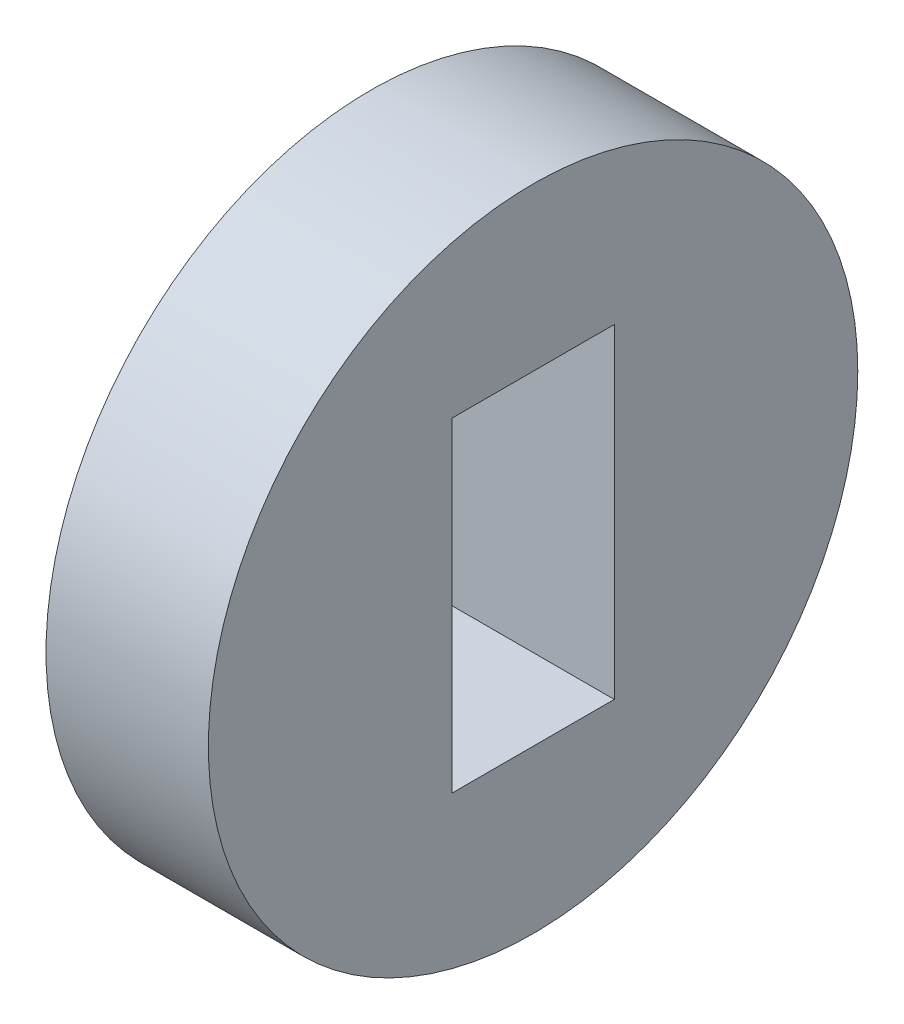
ISO-10303-21;
HEADER;
FILE_DESCRIPTION(('STEP AP214'),'2;1');
FILE_NAME('part.step','',(''),(''),'','','');
FILE_SCHEMA(('AUTOMOTIVE_DESIGN { 1 0 10303 214 1 1 1 1 }'));
ENDSEC;
DATA;
#1=APPLICATION_CONTEXT('core data for automotive mechanical design processes');
#2=APPLICATION_PROTOCOL_DEFINITION('international standard','automotive_design',2000,#1);
#3=PRODUCT_CONTEXT('',#1,'mechanical');
#4=PRODUCT('Part','Part','',(#3));
#5=PRODUCT_RELATED_PRODUCT_CATEGORY('part','',(#4));
#6=PRODUCT_DEFINITION_FORMATION('','',#4);
#7=PRODUCT_DEFINITION_CONTEXT('part definition',#1,'design');
#8=PRODUCT_DEFINITION('design','',#6,#7);
#9=PRODUCT_DEFINITION_SHAPE('','',#8);
#10=(LENGTH_UNIT() NAMED_UNIT(*) SI_UNIT(.MILLI.,.METRE.));
#11=(NAMED_UNIT(*) PLANE_ANGLE_UNIT() SI_UNIT($,.RADIAN.));
#12=(NAMED_UNIT(*) SI_UNIT($,.STERADIAN.) SOLID_ANGLE_UNIT());
#13=UNCERTAINTY_MEASURE_WITH_UNIT(LENGTH_MEASURE(1.E-05),#10,'distance_accuracy_value','');
#14=(GEOMETRIC_REPRESENTATION_CONTEXT(3) GLOBAL_UNCERTAINTY_ASSIGNED_CONTEXT((#13)) GLOBAL_UNIT_ASSIGNED_CONTEXT((#10,
#11,#12)) REPRESENTATION_CONTEXT('',''));
#15=CARTESIAN_POINT('',(0.,0.,0.));
#16=DIRECTION('',(0.,0.,1.));
#17=DIRECTION('',(1.,0.,0.));
#18=AXIS2_PLACEMENT_3D('',#15,#16,#17);
#19=CARTESIAN_POINT('',(3.,-4.15217083001107,0.));
#20=DIRECTION('',(0.,-1.,0.));
#21=DIRECTION('',(0.,0.,-1.));
#22=AXIS2_PLACEMENT_3D('',#19,#20,#21);
#23=PLANE('',#22);
#24=DIRECTION('',(0.,0.,1.));
#25=VECTOR('',#24,1.);
#26=CARTESIAN_POINT('',(0.,-4.15217083001107,0.));
#27=LINE('',#26,#25);
#28=CARTESIAN_POINT('',(0.,-4.15217083001107,32.080329286508));
#29=VERTEX_POINT('',#28);
#30=CARTESIAN_POINT('',(0.,-4.15217083001107,35.080329286508));
#31=VERTEX_POINT('',#30);
#32=EDGE_CURVE('E102',#29,#31,#27,.T.);
#33=ORIENTED_EDGE('',*,*,#32,.F.);
#34=DIRECTION('',(-1.,0.,0.));
#35=VECTOR('',#34,1.);
#36=CARTESIAN_POINT('',(3.,-4.15217083001107,32.080329286508));
#37=LINE('',#36,#35);
#38=CARTESIAN_POINT('',(3.,-4.15217083001107,32.080329286508));
#39=VERTEX_POINT('',#38);
#40=EDGE_CURVE('E11',#39,#29,#37,.T.);
#41=ORIENTED_EDGE('',*,*,#40,.F.);
#42=DIRECTION('',(0.,0.,1.));
#43=VECTOR('',#42,1.);
#44=CARTESIAN_POINT('',(3.,-4.15217083001107,0.));
#45=LINE('',#44,#43);
#46=CARTESIAN_POINT('',(3.,-4.15217083001107,35.080329286508));
#47=VERTEX_POINT('',#46);
#48=EDGE_CURVE('E91',#39,#47,#45,.T.);
#49=ORIENTED_EDGE('',*,*,#48,.T.);
#50=DIRECTION('',(-1.,0.,0.));
#51=VECTOR('',#50,1.);
#52=CARTESIAN_POINT('',(3.,-4.15217083001107,35.080329286508));
#53=LINE('',#52,#51);
#54=EDGE_CURVE('E51',#47,#31,#53,.T.);
#55=ORIENTED_EDGE('',*,*,#54,.T.);
#56=EDGE_LOOP('',(#33,#41,#49,#55));
#57=FACE_BOUND('',#56,.T.);
#58=ADVANCED_FACE('F35',(#57),#23,.T.);
#59=CARTESIAN_POINT('',(3.,0.,32.080329286508));
#60=DIRECTION('',(0.,0.,1.));
#61=DIRECTION('',(1.,0.,0.));
#62=AXIS2_PLACEMENT_3D('',#59,#60,#61);
#63=PLANE('',#62);
#64=DIRECTION('',(0.,1.,0.));
#65=VECTOR('',#64,1.);
#66=CARTESIAN_POINT('',(0.,0.,32.080329286508));
#67=LINE('',#66,#65);
#68=CARTESIAN_POINT('',(0.,-10.1521708300111,32.080329286508));
#69=VERTEX_POINT('',#68);
#70=EDGE_CURVE('E81',#69,#29,#67,.T.);
#71=ORIENTED_EDGE('',*,*,#70,.F.);
#72=DIRECTION('',(-1.,0.,0.));
#73=VECTOR('',#72,1.);
#74=CARTESIAN_POINT('',(3.,-10.1521708300111,32.080329286508));
#75=LINE('',#74,#73);
#76=CARTESIAN_POINT('',(3.,-10.1521708300111,32.080329286508));
#77=VERTEX_POINT('',#76);
#78=EDGE_CURVE('E43',#77,#69,#75,.T.);
#79=ORIENTED_EDGE('',*,*,#78,.F.);
#80=DIRECTION('',(0.,1.,0.));
#81=VECTOR('',#80,1.);
#82=CARTESIAN_POINT('',(3.,0.,32.080329286508));
#83=LINE('',#82,#81);
#84=EDGE_CURVE('E79',#77,#39,#83,.T.);
#85=ORIENTED_EDGE('',*,*,#84,.T.);
#86=ORIENTED_EDGE('',*,*,#40,.T.);
#87=EDGE_LOOP('',(#71,#79,#85,#86));
#88=FACE_BOUND('',#87,.T.);
#89=ADVANCED_FACE('F78',(#88),#63,.T.);
#90=CARTESIAN_POINT('',(3.,-10.1521708300111,0.));
#91=DIRECTION('',(0.,1.,0.));
#92=DIRECTION('',(0.,0.,1.));
#93=AXIS2_PLACEMENT_3D('',#90,#91,#92);
#94=PLANE('',#93);
#95=DIRECTION('',(0.,0.,-1.));
#96=VECTOR('',#95,1.);
#97=CARTESIAN_POINT('',(0.,-10.1521708300111,0.));
#98=LINE('',#97,#96);
#99=CARTESIAN_POINT('',(0.,-10.1521708300111,35.080329286508));
#100=VERTEX_POINT('',#99);
#101=EDGE_CURVE('E105',#100,#69,#98,.T.);
#102=ORIENTED_EDGE('',*,*,#101,.F.);
#103=DIRECTION('',(-1.,0.,0.));
#104=VECTOR('',#103,1.);
#105=CARTESIAN_POINT('',(3.,-10.1521708300111,35.080329286508));
#106=LINE('',#105,#104);
#107=CARTESIAN_POINT('',(3.,-10.1521708300111,35.080329286508));
#108=VERTEX_POINT('',#107);
#109=EDGE_CURVE('E64',#108,#100,#106,.T.);
#110=ORIENTED_EDGE('',*,*,#109,.F.);
#111=DIRECTION('',(0.,0.,-1.));
#112=VECTOR('',#111,1.);
#113=CARTESIAN_POINT('',(3.,-10.1521708300111,0.));
#114=LINE('',#113,#112);
#115=EDGE_CURVE('E90',#108,#77,#114,.T.);
#116=ORIENTED_EDGE('',*,*,#115,.T.);
#117=ORIENTED_EDGE('',*,*,#78,.T.);
#118=EDGE_LOOP('',(#102,#110,#116,#117));
#119=FACE_BOUND('',#118,.T.);
#120=ADVANCED_FACE('F93',(#119),#94,.T.);
#121=CARTESIAN_POINT('',(3.,0.,35.080329286508));
#122=DIRECTION('',(0.,0.,-1.));
#123=DIRECTION('',(-1.,0.,0.));
#124=AXIS2_PLACEMENT_3D('',#121,#122,#123);
#125=PLANE('',#124);
#126=DIRECTION('',(0.,-1.,0.));
#127=VECTOR('',#126,1.);
#128=CARTESIAN_POINT('',(0.,0.,35.080329286508));
#129=LINE('',#128,#127);
#130=EDGE_CURVE('E107',#31,#100,#129,.T.);
#131=ORIENTED_EDGE('',*,*,#130,.F.);
#132=ORIENTED_EDGE('',*,*,#54,.F.);
#133=DIRECTION('',(0.,-1.,0.));
#134=VECTOR('',#133,1.);
#135=CARTESIAN_POINT('',(3.,0.,35.080329286508));
#136=LINE('',#135,#134);
#137=EDGE_CURVE('E94',#47,#108,#136,.T.);
#138=ORIENTED_EDGE('',*,*,#137,.T.);
#139=ORIENTED_EDGE('',*,*,#109,.T.);
#140=EDGE_LOOP('',(#131,#132,#138,#139));
#141=FACE_BOUND('',#140,.T.);
#142=ADVANCED_FACE('F116',(#141),#125,.T.);
#143=CARTESIAN_POINT('',(3.,-7.15217083001107,33.580329286508));
#144=DIRECTION('',(-1.,0.,0.));
#145=DIRECTION('',(0.,0.,1.));
#146=AXIS2_PLACEMENT_3D('',#143,#144,#145);
#147=CYLINDRICAL_SURFACE('',#146,6.);
#148=CARTESIAN_POINT('',(3.,-7.15217083001107,33.580329286508));
#149=DIRECTION('',(1.,0.,0.));
#150=DIRECTION('',(0.,0.,-1.));
#151=AXIS2_PLACEMENT_3D('',#148,#149,#150);
#152=CIRCLE('',#151,6.);
#153=CARTESIAN_POINT('',(3.,-7.15217083001107,27.580329286508));
#154=VERTEX_POINT('',#153);
#155=EDGE_CURVE('E96',#154,#154,#152,.T.);
#156=ORIENTED_EDGE('',*,*,#155,.F.);
#157=EDGE_LOOP('',(#156));
#158=FACE_BOUND('',#157,.T.);
#159=CARTESIAN_POINT('',(0.,-7.15217083001107,33.580329286508));
#160=DIRECTION('',(1.,0.,0.));
#161=DIRECTION('',(0.,0.,-1.));
#162=AXIS2_PLACEMENT_3D('',#159,#160,#161);
#163=CIRCLE('',#162,6.);
#164=CARTESIAN_POINT('',(0.,-7.15217083001107,27.580329286508));
#165=VERTEX_POINT('',#164);
#166=EDGE_CURVE('E110',#165,#165,#163,.T.);
#167=ORIENTED_EDGE('',*,*,#166,.T.);
#168=EDGE_LOOP('',(#167));
#169=FACE_BOUND('',#168,.T.);
#170=ADVANCED_FACE('F118',(#158,#169),#147,.T.);
#171=CARTESIAN_POINT('',(3.,0.,0.));
#172=DIRECTION('',(1.,0.,0.));
#173=DIRECTION('',(0.,0.,-1.));
#174=AXIS2_PLACEMENT_3D('',#171,#172,#173);
#175=PLANE('',#174);
#176=ORIENTED_EDGE('',*,*,#48,.F.);
#177=ORIENTED_EDGE('',*,*,#84,.F.);
#178=ORIENTED_EDGE('',*,*,#115,.F.);
#179=ORIENTED_EDGE('',*,*,#137,.F.);
#180=EDGE_LOOP('',(#176,#177,#178,#179));
#181=FACE_BOUND('',#180,.T.);
#182=ORIENTED_EDGE('',*,*,#155,.T.);
#183=EDGE_LOOP('',(#182));
#184=FACE_BOUND('',#183,.T.);
#185=ADVANCED_FACE('F87',(#181,#184),#175,.T.);
#186=CARTESIAN_POINT('',(0.,0.,0.));
#187=DIRECTION('',(1.,0.,0.));
#188=DIRECTION('',(0.,0.,-1.));
#189=AXIS2_PLACEMENT_3D('',#186,#187,#188);
#190=PLANE('',#189);
#191=ORIENTED_EDGE('',*,*,#32,.T.);
#192=ORIENTED_EDGE('',*,*,#130,.T.);
#193=ORIENTED_EDGE('',*,*,#101,.T.);
#194=ORIENTED_EDGE('',*,*,#70,.T.);
#195=EDGE_LOOP('',(#191,#192,#193,#194));
#196=FACE_BOUND('',#195,.T.);
#197=ORIENTED_EDGE('',*,*,#166,.F.);
#198=EDGE_LOOP('',(#197));
#199=FACE_BOUND('',#198,.T.);
#200=ADVANCED_FACE('F157',(#196,#199),#190,.F.);
#201=CLOSED_SHELL('',(#58,#89,#120,#142,#170,#185,#200));
#202=MANIFOLD_SOLID_BREP('B2',#201);
#203=ADVANCED_BREP_SHAPE_REPRESENTATION('',(#18,#202),#14);
#204=SHAPE_DEFINITION_REPRESENTATION(#9,#203);
ENDSEC;
END-ISO-10303-21;
